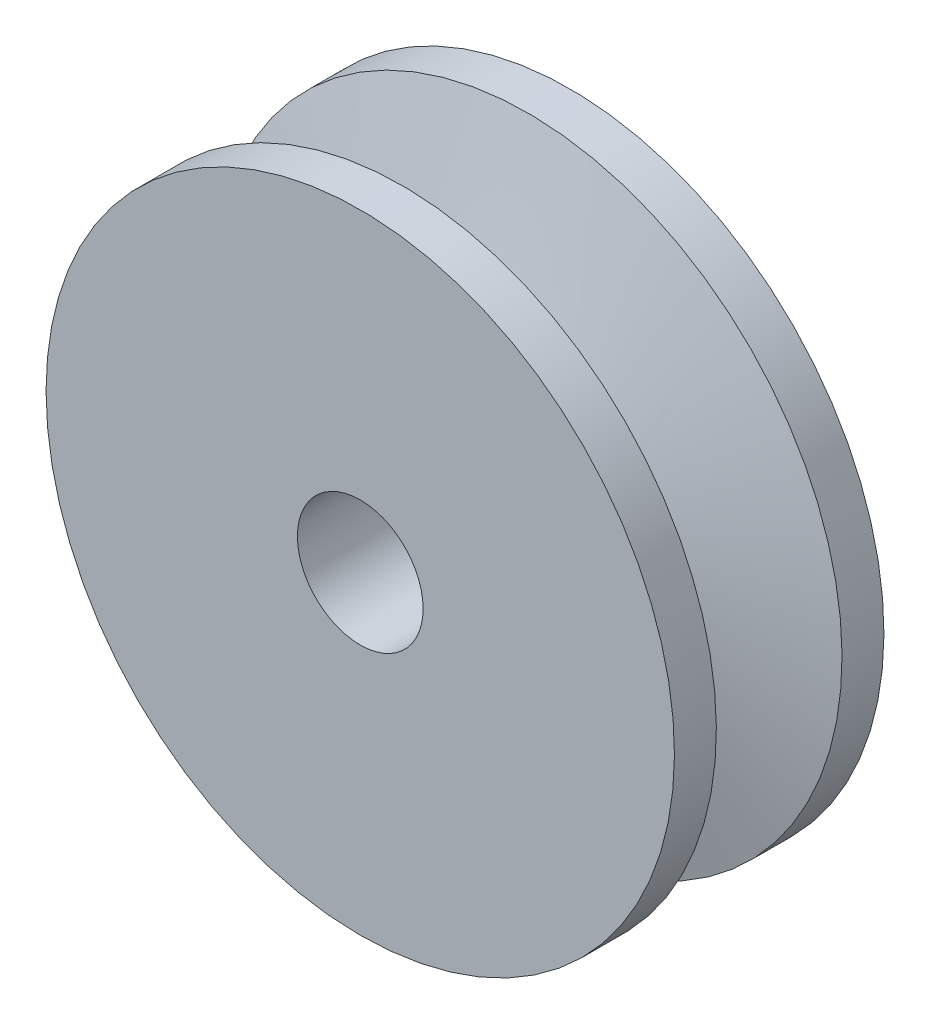
ISO-10303-21;
HEADER;
FILE_DESCRIPTION(('STEP AP214'),'2;1');
FILE_NAME('part.step','',(''),(''),'','','');
FILE_SCHEMA(('AUTOMOTIVE_DESIGN { 1 0 10303 214 1 1 1 1 }'));
ENDSEC;
DATA;
#1=APPLICATION_CONTEXT('core data for automotive mechanical design processes');
#2=APPLICATION_PROTOCOL_DEFINITION('international standard','automotive_design',2000,#1);
#3=PRODUCT_CONTEXT('',#1,'mechanical');
#4=PRODUCT('Part','Part','',(#3));
#5=PRODUCT_RELATED_PRODUCT_CATEGORY('part','',(#4));
#6=PRODUCT_DEFINITION_FORMATION('','',#4);
#7=PRODUCT_DEFINITION_CONTEXT('part definition',#1,'design');
#8=PRODUCT_DEFINITION('design','',#6,#7);
#9=PRODUCT_DEFINITION_SHAPE('','',#8);
#10=(LENGTH_UNIT() NAMED_UNIT(*) SI_UNIT(.MILLI.,.METRE.));
#11=(NAMED_UNIT(*) PLANE_ANGLE_UNIT() SI_UNIT($,.RADIAN.));
#12=(NAMED_UNIT(*) SI_UNIT($,.STERADIAN.) SOLID_ANGLE_UNIT());
#13=UNCERTAINTY_MEASURE_WITH_UNIT(LENGTH_MEASURE(1.E-05),#10,'distance_accuracy_value','');
#14=(GEOMETRIC_REPRESENTATION_CONTEXT(3) GLOBAL_UNCERTAINTY_ASSIGNED_CONTEXT((#13)) GLOBAL_UNIT_ASSIGNED_CONTEXT((#10,
#11,#12)) REPRESENTATION_CONTEXT('',''));
#15=CARTESIAN_POINT('',(0.,0.,0.));
#16=DIRECTION('',(0.,0.,1.));
#17=DIRECTION('',(1.,0.,0.));
#18=AXIS2_PLACEMENT_3D('',#15,#16,#17);
#19=CARTESIAN_POINT('',(0.,0.,5.));
#20=DIRECTION('',(0.,0.,-1.));
#21=DIRECTION('',(-1.,0.,0.));
#22=AXIS2_PLACEMENT_3D('',#19,#20,#21);
#23=CYLINDRICAL_SURFACE('',#22,35.);
#24=CARTESIAN_POINT('',(0.,0.,5.));
#25=DIRECTION('',(0.,0.,1.));
#26=DIRECTION('',(1.,0.,0.));
#27=AXIS2_PLACEMENT_3D('',#24,#25,#26);
#28=CIRCLE('',#27,35.);
#29=CARTESIAN_POINT('',(30.6388963830594,16.9191615758036,5.));
#30=VERTEX_POINT('',#29);
#31=EDGE_CURVE('E11',#30,#30,#28,.T.);
#32=ORIENTED_EDGE('',*,*,#31,.F.);
#33=EDGE_LOOP('',(#32));
#34=FACE_BOUND('',#33,.T.);
#35=CARTESIAN_POINT('',(0.,0.,-5.));
#36=DIRECTION('',(0.,0.,1.));
#37=DIRECTION('',(1.,0.,0.));
#38=AXIS2_PLACEMENT_3D('',#35,#36,#37);
#39=CIRCLE('',#38,35.);
#40=CARTESIAN_POINT('',(30.6388963830594,16.9191615758036,-5.));
#41=VERTEX_POINT('',#40);
#42=EDGE_CURVE('E51',#41,#41,#39,.T.);
#43=ORIENTED_EDGE('',*,*,#42,.T.);
#44=EDGE_LOOP('',(#43));
#45=FACE_BOUND('',#44,.T.);
#46=ADVANCED_FACE('F38',(#34,#45),#23,.T.);
#47=CARTESIAN_POINT('',(30.6388963830594,16.9191615758036,-5.));
#48=CARTESIAN_POINT('',(47.9156429799515,57.698276905102,-15.));
#49=CARTESIAN_POINT('',(64.4772195346665,-44.3586311903153,-5.));
#50=CARTESIAN_POINT('',(163.312196790156,-38.1330090548011,-15.));
#51=CARTESIAN_POINT('',(3.19942676854769,-78.1969543419224,-5.));
#52=CARTESIAN_POINT('',(67.4809108302525,-153.529562865005,-15.));
#53=CARTESIAN_POINT('',(-30.6388963830594,-16.9191615758036,-5.));
#54=CARTESIAN_POINT('',(-47.9156429799515,-57.698276905102,-15.));
#55=CARTESIAN_POINT('',(-64.4772195346665,44.3586311903153,-5.));
#56=CARTESIAN_POINT('',(-163.312196790155,38.1330090548011,-15.));
#57=CARTESIAN_POINT('',(-3.19942676854768,78.1969543419224,-5.));
#58=CARTESIAN_POINT('',(-67.4809108302524,153.529562865005,-15.));
#59=CARTESIAN_POINT('',(30.6388963830594,16.9191615758036,-5.));
#60=CARTESIAN_POINT('',(47.9156429799515,57.698276905102,-15.));
#61=(BOUNDED_SURFACE() B_SPLINE_SURFACE(3,1,((#47,#48),(#49,#50),(#51,#52),(#53,#54),(#55,#56),
(#57,#58),(#59,#60)),.UNSPECIFIED.,.T.,.F.,.F.) B_SPLINE_SURFACE_WITH_KNOTS((4,3,4),(2,2),(0.,
0.5,1.),(0.,1.),.UNSPECIFIED.) GEOMETRIC_REPRESENTATION_ITEM() RATIONAL_B_SPLINE_SURFACE(((1.,
1.),(0.333333333333333,0.333333333333333),(0.333333333333333,0.333333333333333),(1.,1.),
(0.333333333333333,0.333333333333333),(0.333333333333333,0.333333333333333),(1.,1.))) REPRESENTATION_ITEM('') SURFACE());
#62=CARTESIAN_POINT('',(0.,0.,-15.));
#63=DIRECTION('',(0.,0.,-1.));
#64=DIRECTION('',(-1.,0.,0.));
#65=AXIS2_PLACEMENT_3D('',#62,#63,#64);
#66=CIRCLE('',#65,75.);
#67=CARTESIAN_POINT('',(47.9156429799515,57.698276905102,-15.));
#68=VERTEX_POINT('',#67);
#69=EDGE_CURVE('E45',#68,#68,#66,.T.);
#70=CARTESIAN_POINT('',(30.6388963830594,16.9191615758036,-5.));
#71=CARTESIAN_POINT('',(30.8188624934437,17.3439440271504,-5.10416666666667));
#72=CARTESIAN_POINT('',(30.998828603828,17.7687264784973,-5.20833333333333));
#73=CARTESIAN_POINT('',(31.3587608245966,18.618291381191,-5.41666666666667));
#74=CARTESIAN_POINT('',(31.5387269349809,19.0430738325379,-5.52083333333333));
#75=CARTESIAN_POINT('',(31.8986591557495,19.8926387352316,-5.72916666666667));
#76=CARTESIAN_POINT('',(32.0786252661338,20.3174211865784,-5.83333333333333));
#77=CARTESIAN_POINT('',(32.4385574869024,21.1669860892722,-6.04166666666667));
#78=CARTESIAN_POINT('',(32.6185235972866,21.591768540619,-6.14583333333333));
#79=CARTESIAN_POINT('',(32.9784558180552,22.4413334433127,-6.35416666666667));
#80=CARTESIAN_POINT('',(33.1584219284395,22.8661158946596,-6.45833333333333));
#81=CARTESIAN_POINT('',(33.5183541492081,23.7156807973533,-6.66666666666667));
#82=CARTESIAN_POINT('',(33.6983202595924,24.1404632487002,-6.77083333333333));
#83=CARTESIAN_POINT('',(34.058252480361,24.9900281513939,-6.97916666666667));
#84=CARTESIAN_POINT('',(34.2382185907453,25.4148106027407,-7.08333333333333));
#85=CARTESIAN_POINT('',(34.5981508115139,26.2643755054345,-7.29166666666667));
#86=CARTESIAN_POINT('',(34.7781169218982,26.6891579567813,-7.39583333333333));
#87=CARTESIAN_POINT('',(35.1380491426667,27.538722859475,-7.60416666666667));
#88=CARTESIAN_POINT('',(35.318015253051,27.9635053108219,-7.70833333333333));
#89=CARTESIAN_POINT('',(35.6779474738196,28.8130702135156,-7.91666666666667));
#90=CARTESIAN_POINT('',(35.8579135842039,29.2378526648625,-8.02083333333333));
#91=CARTESIAN_POINT('',(36.2178458049725,30.0874175675562,-8.22916666666667));
#92=CARTESIAN_POINT('',(36.3978119153568,30.512200018903,-8.33333333333333));
#93=CARTESIAN_POINT('',(36.7577441361254,31.3617649215968,-8.54166666666667));
#94=CARTESIAN_POINT('',(36.9377102465097,31.7865473729436,-8.64583333333333));
#95=CARTESIAN_POINT('',(37.2976424672782,32.6361122756373,-8.85416666666667));
#96=CARTESIAN_POINT('',(37.4776085776625,33.0608947269842,-8.95833333333334));
#97=CARTESIAN_POINT('',(37.8375407984311,33.9104596296779,-9.16666666666667));
#98=CARTESIAN_POINT('',(38.0175069088154,34.3352420810248,-9.27083333333333));
#99=CARTESIAN_POINT('',(38.377439129584,35.1848069837185,-9.47916666666667));
#100=CARTESIAN_POINT('',(38.5574052399683,35.6095894350654,-9.58333333333333));
#101=CARTESIAN_POINT('',(38.9173374607369,36.4591543377591,-9.79166666666667));
#102=CARTESIAN_POINT('',(39.0973035711212,36.8839367891059,-9.89583333333333));
#103=CARTESIAN_POINT('',(39.4572357918898,37.7335016917996,-10.1041666666667));
#104=CARTESIAN_POINT('',(39.637201902274,38.1582841431465,-10.2083333333333));
#105=CARTESIAN_POINT('',(39.9971341230426,39.0078490458402,-10.4166666666667));
#106=CARTESIAN_POINT('',(40.1771002334269,39.4326314971871,-10.5208333333333));
#107=CARTESIAN_POINT('',(40.5370324541955,40.2821963998808,-10.7291666666667));
#108=CARTESIAN_POINT('',(40.7169985645798,40.7069788512276,-10.8333333333333));
#109=CARTESIAN_POINT('',(41.0769307853484,41.5565437539214,-11.0416666666667));
#110=CARTESIAN_POINT('',(41.2568968957327,41.9813262052682,-11.1458333333333));
#111=CARTESIAN_POINT('',(41.6168291165013,42.8308911079619,-11.3541666666667));
#112=CARTESIAN_POINT('',(41.7967952268855,43.2556735593088,-11.4583333333333));
#113=CARTESIAN_POINT('',(42.1567274476541,44.1052384620025,-11.6666666666667));
#114=CARTESIAN_POINT('',(42.3366935580384,44.5300209133494,-11.7708333333333));
#115=CARTESIAN_POINT('',(42.696625778807,45.3795858160431,-11.9791666666667));
#116=CARTESIAN_POINT('',(42.8765918891913,45.8043682673899,-12.0833333333333));
#117=CARTESIAN_POINT('',(43.2365241099599,46.6539331700837,-12.2916666666667));
#118=CARTESIAN_POINT('',(43.4164902203442,47.0787156214305,-12.3958333333333));
#119=CARTESIAN_POINT('',(43.7764224411128,47.9282805241243,-12.6041666666667));
#120=CARTESIAN_POINT('',(43.9563885514971,48.3530629754711,-12.7083333333333));
#121=CARTESIAN_POINT('',(44.3163207722656,49.2026278781648,-12.9166666666667));
#122=CARTESIAN_POINT('',(44.4962868826499,49.6274103295117,-13.0208333333333));
#123=CARTESIAN_POINT('',(44.8562191034185,50.4769752322054,-13.2291666666667));
#124=CARTESIAN_POINT('',(45.0361852138028,50.9017576835523,-13.3333333333333));
#125=CARTESIAN_POINT('',(45.3961174345714,51.751322586246,-13.5416666666667));
#126=CARTESIAN_POINT('',(45.5760835449557,52.1761050375928,-13.6458333333333));
#127=CARTESIAN_POINT('',(45.9360157657243,53.0256699402866,-13.8541666666667));
#128=CARTESIAN_POINT('',(46.1159818761086,53.4504523916334,-13.9583333333333));
#129=CARTESIAN_POINT('',(46.4759140968772,54.3000172943271,-14.1666666666667));
#130=CARTESIAN_POINT('',(46.6558802072614,54.724799745674,-14.2708333333333));
#131=CARTESIAN_POINT('',(47.01581242803,55.5743646483677,-14.4791666666667));
#132=CARTESIAN_POINT('',(47.1957785384143,55.9991470997146,-14.5833333333333));
#133=CARTESIAN_POINT('',(47.5557107591829,56.8487120024083,-14.7916666666667));
#134=CARTESIAN_POINT('',(47.7356768695672,57.2734944537551,-14.8958333333333));
#135=CARTESIAN_POINT('',(47.9156429799515,57.698276905102,-15.));
#136=B_SPLINE_CURVE_WITH_KNOTS('',3,(#70,#71,#72,#73,#74,#75,#76,#77,#78,#79,#80,#81,#82,#83,
#84,#85,#86,#87,#88,#89,#90,#91,#92,#93,#94,#95,#96,#97,#98,#99,#100,#101,#102,#103,#104,#105,
#106,#107,#108,#109,#110,#111,#112,#113,#114,#115,#116,#117,#118,#119,#120,#121,#122,#123,#124,
#125,#126,#127,#128,#129,#130,#131,#132,#133,#134,#135),.UNSPECIFIED.,.F.,.F.,(4,2,2,2,2,2,2,2,
2,2,2,2,2,2,2,2,2,2,2,2,2,2,2,2,2,2,2,2,2,2,2,2,4),(0.,1.41884024355524,2.83768048711047,
4.25652073066571,5.67536097422094,7.09420121777617,8.51304146133141,9.93188170488665,
11.3507219484419,12.7695621919971,14.1884024355523,15.6072426791076,17.0260829226628,
18.4449231662181,19.8637634097733,21.2826036533285,22.7014438968838,24.120284140439,
25.5391243839942,26.9579646275495,28.3768048711047,29.7956451146599,31.2144853582152,
32.6333256017704,34.0521658453256,35.4710060888809,36.8898463324361,38.3086865759913,
39.7275268195466,41.1463670631018,42.5652073066571,43.9840475502123,45.4028877937675),.UNSPECIFIED.);
#137=EDGE_CURVE('BSEAM92',#41,#68,#136,.T.);
#138=ORIENTED_EDGE('',*,*,#42,.F.);
#139=ORIENTED_EDGE('',*,*,#69,.F.);
#140=ORIENTED_EDGE('',*,*,#137,.T.);
#141=ORIENTED_EDGE('',*,*,#137,.F.);
#142=EDGE_LOOP('',(#138,#140,#139,#141));
#143=FACE_BOUND('',#142,.T.);
#144=ADVANCED_FACE('F92',(#143),#61,.T.);
#145=CARTESIAN_POINT('',(0.,0.,-25.));
#146=DIRECTION('',(0.,0.,1.));
#147=DIRECTION('',(1.,0.,0.));
#148=AXIS2_PLACEMENT_3D('',#145,#146,#147);
#149=CYLINDRICAL_SURFACE('',#148,75.);
#150=CARTESIAN_POINT('',(0.,0.,-25.));
#151=DIRECTION('',(0.,0.,-1.));
#152=DIRECTION('',(-1.,0.,0.));
#153=AXIS2_PLACEMENT_3D('',#150,#151,#152);
#154=CIRCLE('',#153,75.);
#155=CARTESIAN_POINT('',(-75.,0.,-25.));
#156=VERTEX_POINT('',#155);
#157=EDGE_CURVE('E57',#156,#156,#154,.T.);
#158=ORIENTED_EDGE('',*,*,#157,.F.);
#159=EDGE_LOOP('',(#158));
#160=FACE_BOUND('',#159,.T.);
#161=ORIENTED_EDGE('',*,*,#69,.T.);
#162=EDGE_LOOP('',(#161));
#163=FACE_BOUND('',#162,.T.);
#164=ADVANCED_FACE('F87',(#160,#163),#149,.T.);
#165=CARTESIAN_POINT('',(0.,0.,-25.));
#166=DIRECTION('',(0.,0.,-1.));
#167=DIRECTION('',(-1.,0.,0.));
#168=AXIS2_PLACEMENT_3D('',#165,#166,#167);
#169=PLANE('',#168);
#170=CARTESIAN_POINT('',(0.,0.,-25.));
#171=DIRECTION('',(0.,0.,-1.));
#172=DIRECTION('',(-1.,0.,0.));
#173=AXIS2_PLACEMENT_3D('',#170,#171,#172);
#174=CIRCLE('',#173,15.);
#175=CARTESIAN_POINT('',(-15.,0.,-25.));
#176=VERTEX_POINT('',#175);
#177=EDGE_CURVE('E71',#176,#176,#174,.T.);
#178=ORIENTED_EDGE('',*,*,#177,.F.);
#179=EDGE_LOOP('',(#178));
#180=FACE_BOUND('',#179,.T.);
#181=ORIENTED_EDGE('',*,*,#157,.T.);
#182=EDGE_LOOP('',(#181));
#183=FACE_BOUND('',#182,.T.);
#184=ADVANCED_FACE('F83',(#180,#183),#169,.T.);
#185=CARTESIAN_POINT('',(0.,0.,25.));
#186=DIRECTION('',(0.,0.,1.));
#187=DIRECTION('',(-1.,0.,0.));
#188=AXIS2_PLACEMENT_3D('',#185,#186,#187);
#189=PLANE('',#188);
#190=CARTESIAN_POINT('',(0.,0.,25.));
#191=DIRECTION('',(0.,0.,1.));
#192=DIRECTION('',(1.,0.,0.));
#193=AXIS2_PLACEMENT_3D('',#190,#191,#192);
#194=CIRCLE('',#193,15.);
#195=CARTESIAN_POINT('',(15.,0.,25.));
#196=VERTEX_POINT('',#195);
#197=EDGE_CURVE('E72',#196,#196,#194,.F.);
#198=ORIENTED_EDGE('',*,*,#197,.T.);
#199=EDGE_LOOP('',(#198));
#200=FACE_BOUND('',#199,.T.);
#201=CARTESIAN_POINT('',(0.,0.,25.));
#202=DIRECTION('',(0.,0.,-1.));
#203=DIRECTION('',(-1.,0.,0.));
#204=AXIS2_PLACEMENT_3D('',#201,#202,#203);
#205=CIRCLE('',#204,75.);
#206=CARTESIAN_POINT('',(-75.,0.,25.));
#207=VERTEX_POINT('',#206);
#208=EDGE_CURVE('E63',#207,#207,#205,.T.);
#209=ORIENTED_EDGE('',*,*,#208,.F.);
#210=EDGE_LOOP('',(#209));
#211=FACE_BOUND('',#210,.T.);
#212=ADVANCED_FACE('F86',(#200,#211),#189,.T.);
#213=CARTESIAN_POINT('',(0.,0.,25.));
#214=DIRECTION('',(0.,0.,-1.));
#215=DIRECTION('',(1.,0.,0.));
#216=AXIS2_PLACEMENT_3D('',#213,#214,#215);
#217=CYLINDRICAL_SURFACE('',#216,75.);
#218=ORIENTED_EDGE('',*,*,#208,.T.);
#219=EDGE_LOOP('',(#218));
#220=FACE_BOUND('',#219,.T.);
#221=CARTESIAN_POINT('',(0.,0.,15.));
#222=DIRECTION('',(0.,0.,-1.));
#223=DIRECTION('',(-1.,0.,0.));
#224=AXIS2_PLACEMENT_3D('',#221,#222,#223);
#225=CIRCLE('',#224,75.);
#226=CARTESIAN_POINT('',(47.9156429799515,57.698276905102,15.));
#227=VERTEX_POINT('',#226);
#228=EDGE_CURVE('E67',#227,#227,#225,.T.);
#229=ORIENTED_EDGE('',*,*,#228,.F.);
#230=EDGE_LOOP('',(#229));
#231=FACE_BOUND('',#230,.T.);
#232=ADVANCED_FACE('F130',(#220,#231),#217,.T.);
#233=CARTESIAN_POINT('',(30.6388963830594,16.9191615758036,5.));
#234=CARTESIAN_POINT('',(47.9156429799515,57.698276905102,15.));
#235=CARTESIAN_POINT('',(64.4772195346665,-44.3586311903153,5.));
#236=CARTESIAN_POINT('',(163.312196790156,-38.1330090548011,15.));
#237=CARTESIAN_POINT('',(3.19942676854769,-78.1969543419224,5.));
#238=CARTESIAN_POINT('',(67.4809108302525,-153.529562865005,15.));
#239=CARTESIAN_POINT('',(-30.6388963830594,-16.9191615758036,5.));
#240=CARTESIAN_POINT('',(-47.9156429799515,-57.698276905102,15.));
#241=CARTESIAN_POINT('',(-64.4772195346665,44.3586311903153,5.));
#242=CARTESIAN_POINT('',(-163.312196790155,38.1330090548011,15.));
#243=CARTESIAN_POINT('',(-3.19942676854768,78.1969543419224,5.));
#244=CARTESIAN_POINT('',(-67.4809108302524,153.529562865005,15.));
#245=CARTESIAN_POINT('',(30.6388963830594,16.9191615758036,5.));
#246=CARTESIAN_POINT('',(47.9156429799515,57.698276905102,15.));
#247=(BOUNDED_SURFACE() B_SPLINE_SURFACE(3,1,((#233,#234),(#235,#236),(#237,#238),(#239,#240),
(#241,#242),(#243,#244),(#245,#246)),.UNSPECIFIED.,.T.,.F.,.F.) B_SPLINE_SURFACE_WITH_KNOTS((4,
3,4),(2,2),(0.,0.5,1.),(0.,1.),
.UNSPECIFIED.) GEOMETRIC_REPRESENTATION_ITEM() RATIONAL_B_SPLINE_SURFACE(((1.,1.),
(0.333333333333333,0.333333333333333),(0.333333333333333,0.333333333333333),(1.,1.),
(0.333333333333333,0.333333333333333),(0.333333333333333,0.333333333333333),(1.,1.))) REPRESENTATION_ITEM('') SURFACE());
#248=CARTESIAN_POINT('',(30.6388963830594,16.9191615758036,5.));
#249=CARTESIAN_POINT('',(30.8188624934437,17.3439440271504,5.10416666666667));
#250=CARTESIAN_POINT('',(30.998828603828,17.7687264784973,5.20833333333333));
#251=CARTESIAN_POINT('',(31.3587608245966,18.618291381191,5.41666666666667));
#252=CARTESIAN_POINT('',(31.5387269349809,19.0430738325379,5.52083333333333));
#253=CARTESIAN_POINT('',(31.8986591557495,19.8926387352316,5.72916666666667));
#254=CARTESIAN_POINT('',(32.0786252661338,20.3174211865784,5.83333333333333));
#255=CARTESIAN_POINT('',(32.4385574869024,21.1669860892722,6.04166666666667));
#256=CARTESIAN_POINT('',(32.6185235972866,21.591768540619,6.14583333333333));
#257=CARTESIAN_POINT('',(32.9784558180552,22.4413334433127,6.35416666666667));
#258=CARTESIAN_POINT('',(33.1584219284395,22.8661158946596,6.45833333333333));
#259=CARTESIAN_POINT('',(33.5183541492081,23.7156807973533,6.66666666666667));
#260=CARTESIAN_POINT('',(33.6983202595924,24.1404632487002,6.77083333333333));
#261=CARTESIAN_POINT('',(34.058252480361,24.9900281513939,6.97916666666667));
#262=CARTESIAN_POINT('',(34.2382185907453,25.4148106027407,7.08333333333333));
#263=CARTESIAN_POINT('',(34.5981508115139,26.2643755054345,7.29166666666667));
#264=CARTESIAN_POINT('',(34.7781169218982,26.6891579567813,7.39583333333333));
#265=CARTESIAN_POINT('',(35.1380491426667,27.538722859475,7.60416666666667));
#266=CARTESIAN_POINT('',(35.318015253051,27.9635053108219,7.70833333333333));
#267=CARTESIAN_POINT('',(35.6779474738196,28.8130702135156,7.91666666666667));
#268=CARTESIAN_POINT('',(35.8579135842039,29.2378526648625,8.02083333333333));
#269=CARTESIAN_POINT('',(36.2178458049725,30.0874175675562,8.22916666666667));
#270=CARTESIAN_POINT('',(36.3978119153568,30.512200018903,8.33333333333333));
#271=CARTESIAN_POINT('',(36.7577441361254,31.3617649215968,8.54166666666667));
#272=CARTESIAN_POINT('',(36.9377102465097,31.7865473729436,8.64583333333333));
#273=CARTESIAN_POINT('',(37.2976424672782,32.6361122756373,8.85416666666667));
#274=CARTESIAN_POINT('',(37.4776085776625,33.0608947269842,8.95833333333334));
#275=CARTESIAN_POINT('',(37.8375407984311,33.9104596296779,9.16666666666667));
#276=CARTESIAN_POINT('',(38.0175069088154,34.3352420810248,9.27083333333333));
#277=CARTESIAN_POINT('',(38.377439129584,35.1848069837185,9.47916666666667));
#278=CARTESIAN_POINT('',(38.5574052399683,35.6095894350654,9.58333333333333));
#279=CARTESIAN_POINT('',(38.9173374607369,36.4591543377591,9.79166666666667));
#280=CARTESIAN_POINT('',(39.0973035711212,36.8839367891059,9.89583333333333));
#281=CARTESIAN_POINT('',(39.4572357918898,37.7335016917996,10.1041666666667));
#282=CARTESIAN_POINT('',(39.637201902274,38.1582841431465,10.2083333333333));
#283=CARTESIAN_POINT('',(39.9971341230426,39.0078490458402,10.4166666666667));
#284=CARTESIAN_POINT('',(40.1771002334269,39.4326314971871,10.5208333333333));
#285=CARTESIAN_POINT('',(40.5370324541955,40.2821963998808,10.7291666666667));
#286=CARTESIAN_POINT('',(40.7169985645798,40.7069788512276,10.8333333333333));
#287=CARTESIAN_POINT('',(41.0769307853484,41.5565437539214,11.0416666666667));
#288=CARTESIAN_POINT('',(41.2568968957327,41.9813262052682,11.1458333333333));
#289=CARTESIAN_POINT('',(41.6168291165013,42.8308911079619,11.3541666666667));
#290=CARTESIAN_POINT('',(41.7967952268855,43.2556735593088,11.4583333333333));
#291=CARTESIAN_POINT('',(42.1567274476541,44.1052384620025,11.6666666666667));
#292=CARTESIAN_POINT('',(42.3366935580384,44.5300209133494,11.7708333333333));
#293=CARTESIAN_POINT('',(42.696625778807,45.3795858160431,11.9791666666667));
#294=CARTESIAN_POINT('',(42.8765918891913,45.8043682673899,12.0833333333333));
#295=CARTESIAN_POINT('',(43.2365241099599,46.6539331700837,12.2916666666667));
#296=CARTESIAN_POINT('',(43.4164902203442,47.0787156214305,12.3958333333333));
#297=CARTESIAN_POINT('',(43.7764224411128,47.9282805241243,12.6041666666667));
#298=CARTESIAN_POINT('',(43.9563885514971,48.3530629754711,12.7083333333333));
#299=CARTESIAN_POINT('',(44.3163207722656,49.2026278781648,12.9166666666667));
#300=CARTESIAN_POINT('',(44.4962868826499,49.6274103295117,13.0208333333333));
#301=CARTESIAN_POINT('',(44.8562191034185,50.4769752322054,13.2291666666667));
#302=CARTESIAN_POINT('',(45.0361852138028,50.9017576835523,13.3333333333333));
#303=CARTESIAN_POINT('',(45.3961174345714,51.751322586246,13.5416666666667));
#304=CARTESIAN_POINT('',(45.5760835449557,52.1761050375928,13.6458333333333));
#305=CARTESIAN_POINT('',(45.9360157657243,53.0256699402866,13.8541666666667));
#306=CARTESIAN_POINT('',(46.1159818761086,53.4504523916334,13.9583333333333));
#307=CARTESIAN_POINT('',(46.4759140968772,54.3000172943271,14.1666666666667));
#308=CARTESIAN_POINT('',(46.6558802072614,54.724799745674,14.2708333333333));
#309=CARTESIAN_POINT('',(47.01581242803,55.5743646483677,14.4791666666667));
#310=CARTESIAN_POINT('',(47.1957785384143,55.9991470997146,14.5833333333333));
#311=CARTESIAN_POINT('',(47.5557107591829,56.8487120024083,14.7916666666667));
#312=CARTESIAN_POINT('',(47.7356768695672,57.2734944537551,14.8958333333333));
#313=CARTESIAN_POINT('',(47.9156429799515,57.698276905102,15.));
#314=B_SPLINE_CURVE_WITH_KNOTS('',3,(#248,#249,#250,#251,#252,#253,#254,#255,#256,#257,#258,
#259,#260,#261,#262,#263,#264,#265,#266,#267,#268,#269,#270,#271,#272,#273,#274,#275,#276,#277,
#278,#279,#280,#281,#282,#283,#284,#285,#286,#287,#288,#289,#290,#291,#292,#293,#294,#295,#296,
#297,#298,#299,#300,#301,#302,#303,#304,#305,#306,#307,#308,#309,#310,#311,#312,#313),
.UNSPECIFIED.,.F.,.F.,(4,2,2,2,2,2,2,2,2,2,2,2,2,2,2,2,2,2,2,2,2,2,2,2,2,2,2,2,2,2,2,2,4),(0.,
1.41884024355524,2.83768048711047,4.25652073066571,5.67536097422094,7.09420121777617,
8.51304146133141,9.93188170488665,11.3507219484419,12.7695621919971,14.1884024355523,
15.6072426791076,17.0260829226628,18.4449231662181,19.8637634097733,21.2826036533285,
22.7014438968838,24.120284140439,25.5391243839942,26.9579646275495,28.3768048711047,
29.7956451146599,31.2144853582152,32.6333256017704,34.0521658453256,35.4710060888809,
36.8898463324361,38.3086865759913,39.7275268195466,41.1463670631018,42.5652073066571,
43.9840475502123,45.4028877937675),.UNSPECIFIED.);
#315=EDGE_CURVE('BSEAM140',#30,#227,#314,.T.);
#316=ORIENTED_EDGE('',*,*,#31,.T.);
#317=ORIENTED_EDGE('',*,*,#228,.T.);
#318=ORIENTED_EDGE('',*,*,#315,.T.);
#319=ORIENTED_EDGE('',*,*,#315,.F.);
#320=EDGE_LOOP('',(#316,#318,#317,#319));
#321=FACE_BOUND('',#320,.T.);
#322=ADVANCED_FACE('F140',(#321),#247,.F.);
#323=CARTESIAN_POINT('',(0.,0.,25.001));
#324=DIRECTION('',(0.,0.,-1.));
#325=DIRECTION('',(-1.,0.,0.));
#326=AXIS2_PLACEMENT_3D('',#323,#324,#325);
#327=CYLINDRICAL_SURFACE('',#326,15.);
#328=ORIENTED_EDGE('',*,*,#197,.F.);
#329=EDGE_LOOP('',(#328));
#330=FACE_BOUND('',#329,.T.);
#331=ORIENTED_EDGE('',*,*,#177,.T.);
#332=EDGE_LOOP('',(#331));
#333=FACE_BOUND('',#332,.T.);
#334=ADVANCED_FACE('F81',(#330,#333),#327,.F.);
#335=CLOSED_SHELL('',(#46,#144,#164,#184,#212,#232,#322,#334));
#336=MANIFOLD_SOLID_BREP('B2',#335);
#337=ADVANCED_BREP_SHAPE_REPRESENTATION('',(#18,#336),#14);
#338=SHAPE_DEFINITION_REPRESENTATION(#9,#337);
ENDSEC;
END-ISO-10303-21;
